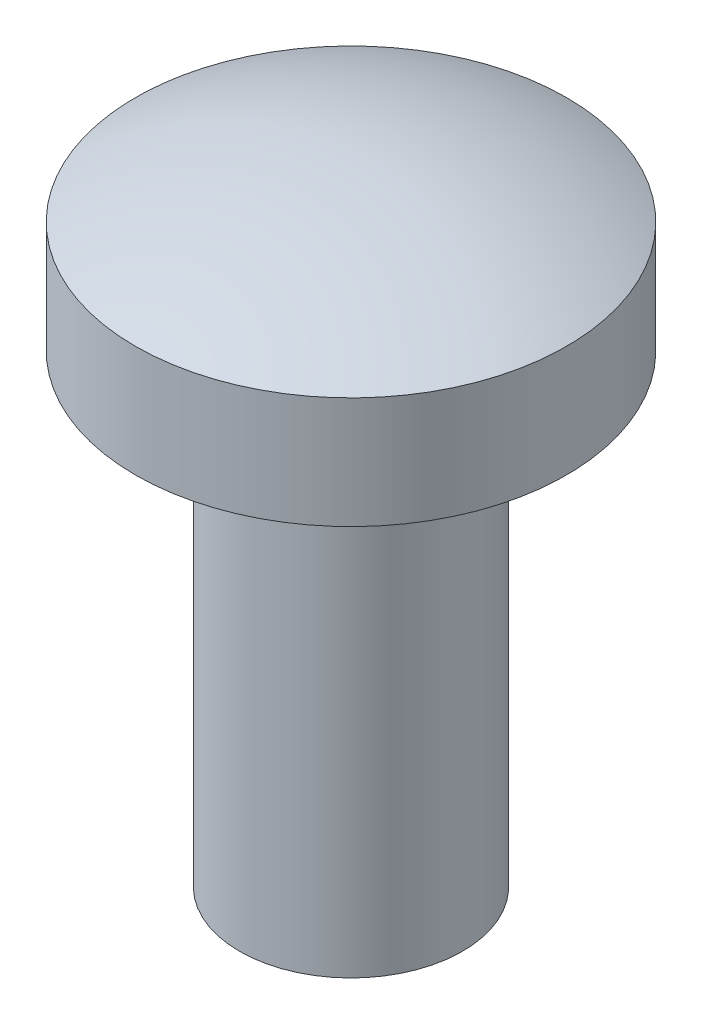
ISO-10303-21;
HEADER;
FILE_DESCRIPTION(('STEP AP214'),'2;1');
FILE_NAME('part.step','',(''),(''),'','','');
FILE_SCHEMA(('AUTOMOTIVE_DESIGN { 1 0 10303 214 1 1 1 1 }'));
ENDSEC;
DATA;
#1=APPLICATION_CONTEXT('core data for automotive mechanical design processes');
#2=APPLICATION_PROTOCOL_DEFINITION('international standard','automotive_design',2000,#1);
#3=PRODUCT_CONTEXT('',#1,'mechanical');
#4=PRODUCT('Part','Part','',(#3));
#5=PRODUCT_RELATED_PRODUCT_CATEGORY('part','',(#4));
#6=PRODUCT_DEFINITION_FORMATION('','',#4);
#7=PRODUCT_DEFINITION_CONTEXT('part definition',#1,'design');
#8=PRODUCT_DEFINITION('design','',#6,#7);
#9=PRODUCT_DEFINITION_SHAPE('','',#8);
#10=(LENGTH_UNIT() NAMED_UNIT(*) SI_UNIT(.MILLI.,.METRE.));
#11=(NAMED_UNIT(*) PLANE_ANGLE_UNIT() SI_UNIT($,.RADIAN.));
#12=(NAMED_UNIT(*) SI_UNIT($,.STERADIAN.) SOLID_ANGLE_UNIT());
#13=UNCERTAINTY_MEASURE_WITH_UNIT(LENGTH_MEASURE(1.E-05),#10,'distance_accuracy_value','');
#14=(GEOMETRIC_REPRESENTATION_CONTEXT(3) GLOBAL_UNCERTAINTY_ASSIGNED_CONTEXT((#13)) GLOBAL_UNIT_ASSIGNED_CONTEXT((#10,
#11,#12)) REPRESENTATION_CONTEXT('',''));
#15=CARTESIAN_POINT('',(0.,0.,0.));
#16=DIRECTION('',(0.,0.,1.));
#17=DIRECTION('',(1.,0.,0.));
#18=AXIS2_PLACEMENT_3D('',#15,#16,#17);
#19=CARTESIAN_POINT('',(0.,-3.175,0.));
#20=DIRECTION('',(0.,1.,0.));
#21=DIRECTION('',(0.,0.,1.));
#22=AXIS2_PLACEMENT_3D('',#19,#20,#21);
#23=PLANE('',#22);
#24=CARTESIAN_POINT('',(0.,-3.175,0.));
#25=DIRECTION('',(0.,1.,0.));
#26=DIRECTION('',(0.,0.,1.));
#27=AXIS2_PLACEMENT_3D('',#24,#25,#26);
#28=CIRCLE('',#27,0.761999999999993);
#29=CARTESIAN_POINT('',(0.,-3.175,0.761999999999979));
#30=VERTEX_POINT('',#29);
#31=EDGE_CURVE('E10',#30,#30,#28,.T.);
#32=ORIENTED_EDGE('',*,*,#31,.F.);
#33=EDGE_LOOP('',(#32));
#34=FACE_BOUND('',#33,.T.);
#35=ADVANCED_FACE('F31',(#34),#23,.F.);
#36=CARTESIAN_POINT('',(0.,58.6008928572079,0.));
#37=DIRECTION('',(0.,1.,0.));
#38=DIRECTION('',(0.,0.,1.));
#39=AXIS2_PLACEMENT_3D('',#36,#37,#38);
#40=CYLINDRICAL_SURFACE('',#39,0.761999999999994);
#41=CARTESIAN_POINT('',(0.,0.,0.));
#42=DIRECTION('',(0.,1.,0.));
#43=DIRECTION('',(0.,0.,1.));
#44=AXIS2_PLACEMENT_3D('',#41,#42,#43);
#45=CIRCLE('',#44,0.761999999999994);
#46=CARTESIAN_POINT('',(0.,0.,0.76199999999998));
#47=VERTEX_POINT('',#46);
#48=EDGE_CURVE('E37',#47,#47,#45,.T.);
#49=ORIENTED_EDGE('',*,*,#48,.F.);
#50=EDGE_LOOP('',(#49));
#51=FACE_BOUND('',#50,.T.);
#52=ORIENTED_EDGE('',*,*,#31,.T.);
#53=EDGE_LOOP('',(#52));
#54=FACE_BOUND('',#53,.T.);
#55=ADVANCED_FACE('F61',(#51,#54),#40,.T.);
#56=CARTESIAN_POINT('',(0.,0.,-0.762000000000008));
#57=DIRECTION('',(0.,1.,0.));
#58=DIRECTION('',(0.,0.,1.));
#59=AXIS2_PLACEMENT_3D('',#56,#57,#58);
#60=PLANE('',#59);
#61=CARTESIAN_POINT('',(0.,0.,0.));
#62=DIRECTION('',(0.,1.,0.));
#63=DIRECTION('',(0.,0.,1.));
#64=AXIS2_PLACEMENT_3D('',#61,#62,#63);
#65=CIRCLE('',#64,1.47319999999999);
#66=CARTESIAN_POINT('',(0.,0.,1.47319999999998));
#67=VERTEX_POINT('',#66);
#68=EDGE_CURVE('E41',#67,#67,#65,.T.);
#69=ORIENTED_EDGE('',*,*,#68,.F.);
#70=EDGE_LOOP('',(#69));
#71=FACE_BOUND('',#70,.T.);
#72=ORIENTED_EDGE('',*,*,#48,.T.);
#73=EDGE_LOOP('',(#72));
#74=FACE_BOUND('',#73,.T.);
#75=ADVANCED_FACE('F56',(#71,#74),#60,.F.);
#76=CARTESIAN_POINT('',(0.,58.6008928572079,0.));
#77=DIRECTION('',(0.,1.,0.));
#78=DIRECTION('',(0.,0.,1.));
#79=AXIS2_PLACEMENT_3D('',#76,#77,#78);
#80=CYLINDRICAL_SURFACE('',#79,1.47319999999999);
#81=CARTESIAN_POINT('',(0.,0.761999999999999,0.));
#82=DIRECTION('',(0.,1.,0.));
#83=DIRECTION('',(0.,0.,1.));
#84=AXIS2_PLACEMENT_3D('',#81,#82,#83);
#85=CIRCLE('',#84,1.47319999999999);
#86=CARTESIAN_POINT('',(0.,0.761999999999998,1.47319999999998));
#87=VERTEX_POINT('',#86);
#88=EDGE_CURVE('E45',#87,#87,#85,.T.);
#89=ORIENTED_EDGE('',*,*,#88,.F.);
#90=EDGE_LOOP('',(#89));
#91=FACE_BOUND('',#90,.T.);
#92=ORIENTED_EDGE('',*,*,#68,.T.);
#93=EDGE_LOOP('',(#92));
#94=FACE_BOUND('',#93,.T.);
#95=ADVANCED_FACE('F53',(#91,#94),#80,.T.);
#96=CARTESIAN_POINT('',(0.,-2.11182857142857,0.));
#97=DIRECTION('',(0.,1.,0.));
#98=DIRECTION('',(0.,0.,-1.));
#99=AXIS2_PLACEMENT_3D('',#96,#97,#98);
#100=SPHERICAL_SURFACE('',#99,3.22942857142857);
#101=ORIENTED_EDGE('',*,*,#88,.T.);
#102=EDGE_LOOP('',(#101));
#103=FACE_BOUND('',#102,.T.);
#104=ADVANCED_FACE('F51',(#103),#100,.T.);
#105=CLOSED_SHELL('',(#35,#55,#75,#95,#104));
#106=MANIFOLD_SOLID_BREP('B2',#105);
#107=ADVANCED_BREP_SHAPE_REPRESENTATION('',(#18,#106),#14);
#108=SHAPE_DEFINITION_REPRESENTATION(#9,#107);
ENDSEC;
END-ISO-10303-21;
